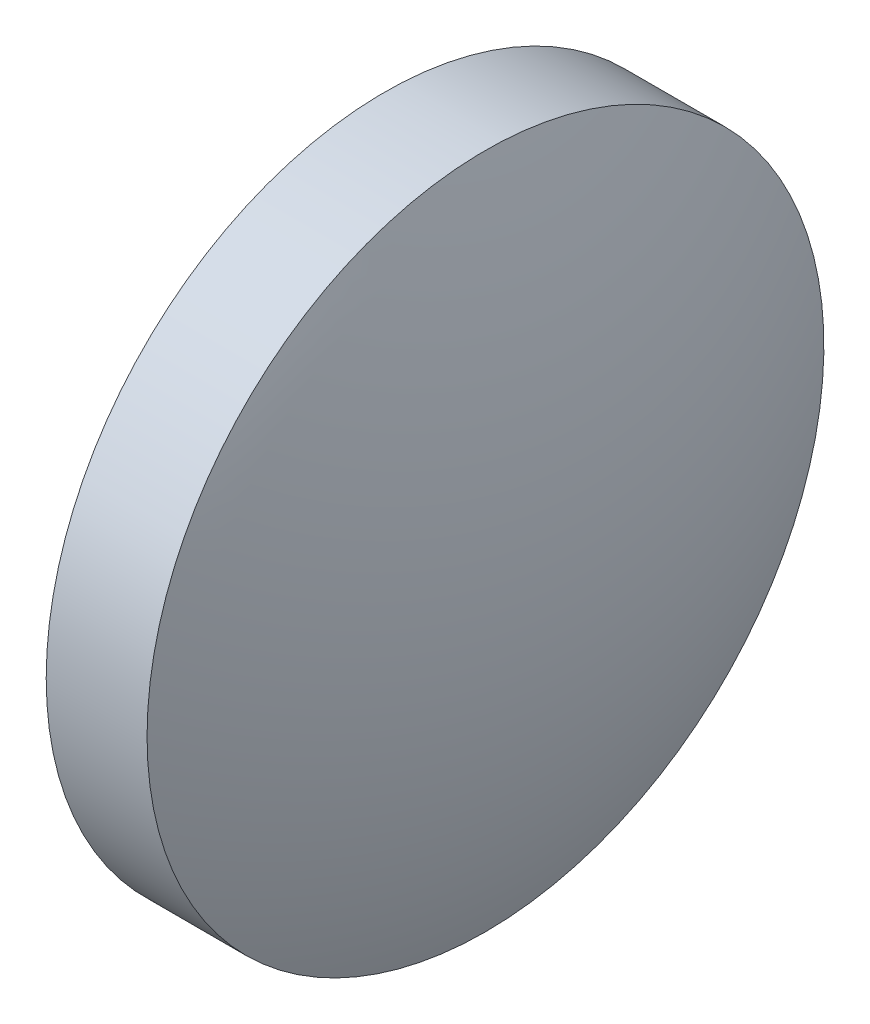
ISO-10303-21;
HEADER;
FILE_DESCRIPTION(('STEP AP214'),'2;1');
FILE_NAME('part.step','',(''),(''),'','','');
FILE_SCHEMA(('AUTOMOTIVE_DESIGN { 1 0 10303 214 1 1 1 1 }'));
ENDSEC;
DATA;
#1=APPLICATION_CONTEXT('core data for automotive mechanical design processes');
#2=APPLICATION_PROTOCOL_DEFINITION('international standard','automotive_design',2000,#1);
#3=PRODUCT_CONTEXT('',#1,'mechanical');
#4=PRODUCT('Part','Part','',(#3));
#5=PRODUCT_RELATED_PRODUCT_CATEGORY('part','',(#4));
#6=PRODUCT_DEFINITION_FORMATION('','',#4);
#7=PRODUCT_DEFINITION_CONTEXT('part definition',#1,'design');
#8=PRODUCT_DEFINITION('design','',#6,#7);
#9=PRODUCT_DEFINITION_SHAPE('','',#8);
#10=(LENGTH_UNIT() NAMED_UNIT(*) SI_UNIT(.MILLI.,.METRE.));
#11=(NAMED_UNIT(*) PLANE_ANGLE_UNIT() SI_UNIT($,.RADIAN.));
#12=(NAMED_UNIT(*) SI_UNIT($,.STERADIAN.) SOLID_ANGLE_UNIT());
#13=UNCERTAINTY_MEASURE_WITH_UNIT(LENGTH_MEASURE(1.E-05),#10,'distance_accuracy_value','');
#14=(GEOMETRIC_REPRESENTATION_CONTEXT(3) GLOBAL_UNCERTAINTY_ASSIGNED_CONTEXT((#13)) GLOBAL_UNIT_ASSIGNED_CONTEXT((#10,
#11,#12)) REPRESENTATION_CONTEXT('',''));
#15=CARTESIAN_POINT('',(0.,0.,0.));
#16=DIRECTION('',(0.,0.,1.));
#17=DIRECTION('',(1.,0.,0.));
#18=AXIS2_PLACEMENT_3D('',#15,#16,#17);
#19=CARTESIAN_POINT('',(651.768616473224,171.216111307135,0.));
#20=DIRECTION('',(-1.,0.,0.));
#21=DIRECTION('',(0.,-1.,0.));
#22=AXIS2_PLACEMENT_3D('',#19,#20,#21);
#23=SPHERICAL_SURFACE('',#22,12.8812376237623);
#24=CARTESIAN_POINT('',(663.639854096986,171.216111307135,0.));
#25=DIRECTION('',(-1.,0.,0.));
#26=DIRECTION('',(0.,0.,1.));
#27=AXIS2_PLACEMENT_3D('',#24,#25,#26);
#28=CIRCLE('',#27,5.);
#29=CARTESIAN_POINT('',(663.639854096986,171.216111307135,5.));
#30=VERTEX_POINT('',#29);
#31=EDGE_CURVE('E10',#30,#30,#28,.T.);
#32=ORIENTED_EDGE('',*,*,#31,.F.);
#33=EDGE_LOOP('',(#32));
#34=FACE_BOUND('',#33,.T.);
#35=ADVANCED_FACE('F35',(#34),#23,.T.);
#36=CARTESIAN_POINT('',(661.352181842921,171.216111307135,0.));
#37=DIRECTION('',(-1.,0.,0.));
#38=DIRECTION('',(0.,0.,1.));
#39=AXIS2_PLACEMENT_3D('',#36,#37,#38);
#40=CYLINDRICAL_SURFACE('',#39,5.);
#41=CARTESIAN_POINT('',(662.149854096986,171.216111307135,0.));
#42=DIRECTION('',(-1.,0.,0.));
#43=DIRECTION('',(0.,0.,1.));
#44=AXIS2_PLACEMENT_3D('',#41,#42,#43);
#45=CIRCLE('',#44,5.);
#46=CARTESIAN_POINT('',(662.149854096986,171.216111307135,5.));
#47=VERTEX_POINT('',#46);
#48=EDGE_CURVE('E41',#47,#47,#45,.T.);
#49=ORIENTED_EDGE('',*,*,#48,.F.);
#50=EDGE_LOOP('',(#49));
#51=FACE_BOUND('',#50,.T.);
#52=ORIENTED_EDGE('',*,*,#31,.T.);
#53=EDGE_LOOP('',(#52));
#54=FACE_BOUND('',#53,.T.);
#55=ADVANCED_FACE('F49',(#51,#54),#40,.T.);
#56=CARTESIAN_POINT('',(662.149854096986,171.216111307135,0.));
#57=DIRECTION('',(1.,0.,0.));
#58=DIRECTION('',(0.,0.,-1.));
#59=AXIS2_PLACEMENT_3D('',#56,#57,#58);
#60=PLANE('',#59);
#61=ORIENTED_EDGE('',*,*,#48,.T.);
#62=EDGE_LOOP('',(#61));
#63=FACE_BOUND('',#62,.T.);
#64=ADVANCED_FACE('F47',(#63),#60,.F.);
#65=CLOSED_SHELL('',(#35,#55,#64));
#66=MANIFOLD_SOLID_BREP('B2',#65);
#67=ADVANCED_BREP_SHAPE_REPRESENTATION('',(#18,#66),#14);
#68=SHAPE_DEFINITION_REPRESENTATION(#9,#67);
ENDSEC;
END-ISO-10303-21;
